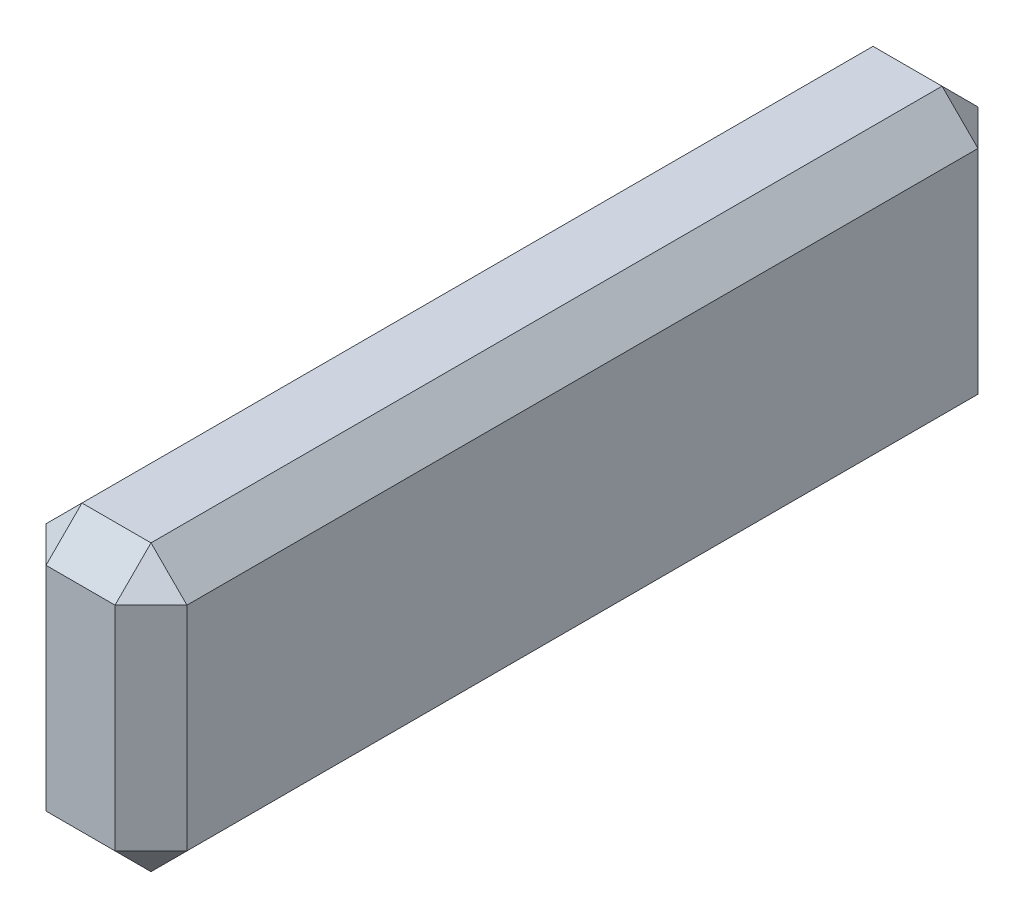
ISO-10303-21;
HEADER;
FILE_DESCRIPTION(('STEP AP214'),'2;1');
FILE_NAME('part.step','',(''),(''),'','','');
FILE_SCHEMA(('AUTOMOTIVE_DESIGN { 1 0 10303 214 1 1 1 1 }'));
ENDSEC;
DATA;
#1=APPLICATION_CONTEXT('core data for automotive mechanical design processes');
#2=APPLICATION_PROTOCOL_DEFINITION('international standard','automotive_design',2000,#1);
#3=PRODUCT_CONTEXT('',#1,'mechanical');
#4=PRODUCT('Part','Part','',(#3));
#5=PRODUCT_RELATED_PRODUCT_CATEGORY('part','',(#4));
#6=PRODUCT_DEFINITION_FORMATION('','',#4);
#7=PRODUCT_DEFINITION_CONTEXT('part definition',#1,'design');
#8=PRODUCT_DEFINITION('design','',#6,#7);
#9=PRODUCT_DEFINITION_SHAPE('','',#8);
#10=(LENGTH_UNIT() NAMED_UNIT(*) SI_UNIT(.MILLI.,.METRE.));
#11=(NAMED_UNIT(*) PLANE_ANGLE_UNIT() SI_UNIT($,.RADIAN.));
#12=(NAMED_UNIT(*) SI_UNIT($,.STERADIAN.) SOLID_ANGLE_UNIT());
#13=UNCERTAINTY_MEASURE_WITH_UNIT(LENGTH_MEASURE(1.E-05),#10,'distance_accuracy_value','');
#14=(GEOMETRIC_REPRESENTATION_CONTEXT(3) GLOBAL_UNCERTAINTY_ASSIGNED_CONTEXT((#13)) GLOBAL_UNIT_ASSIGNED_CONTEXT((#10,
#11,#12)) REPRESENTATION_CONTEXT('',''));
#15=CARTESIAN_POINT('',(0.,0.,0.));
#16=DIRECTION('',(0.,0.,1.));
#17=DIRECTION('',(1.,0.,0.));
#18=AXIS2_PLACEMENT_3D('',#15,#16,#17);
#19=CARTESIAN_POINT('',(3.1115,-6.2865,38.1));
#20=DIRECTION('',(-1.,0.,0.));
#21=DIRECTION('',(0.,0.,1.));
#22=AXIS2_PLACEMENT_3D('',#19,#20,#21);
#23=PLANE('',#22);
#24=DIRECTION('',(0.,-1.,0.));
#25=VECTOR('',#24,1.);
#26=CARTESIAN_POINT('',(3.1115,-6.2865,36.5125));
#27=LINE('',#26,#25);
#28=CARTESIAN_POINT('',(3.1115,4.69899999999999,36.5125));
#29=VERTEX_POINT('',#28);
#30=CARTESIAN_POINT('',(3.1115,-4.699,36.5125));
#31=VERTEX_POINT('',#30);
#32=EDGE_CURVE('E195',#29,#31,#27,.T.);
#33=ORIENTED_EDGE('',*,*,#32,.T.);
#34=DIRECTION('',(0.,0.,-1.));
#35=VECTOR('',#34,1.);
#36=CARTESIAN_POINT('',(3.1115,-4.699,38.1));
#37=LINE('',#36,#35);
#38=CARTESIAN_POINT('',(3.1115,-4.699,1.5875));
#39=VERTEX_POINT('',#38);
#40=EDGE_CURVE('E197',#31,#39,#37,.T.);
#41=ORIENTED_EDGE('',*,*,#40,.T.);
#42=DIRECTION('',(0.,1.,0.));
#43=VECTOR('',#42,1.);
#44=CARTESIAN_POINT('',(3.1115,6.2865,1.5875));
#45=LINE('',#44,#43);
#46=CARTESIAN_POINT('',(3.1115,4.69899999999999,1.5875));
#47=VERTEX_POINT('',#46);
#48=EDGE_CURVE('E191',#39,#47,#45,.T.);
#49=ORIENTED_EDGE('',*,*,#48,.T.);
#50=DIRECTION('',(0.,0.,1.));
#51=VECTOR('',#50,1.);
#52=CARTESIAN_POINT('',(3.1115,4.69899999999999,38.1));
#53=LINE('',#52,#51);
#54=EDGE_CURVE('E193',#47,#29,#53,.T.);
#55=ORIENTED_EDGE('',*,*,#54,.T.);
#56=EDGE_LOOP('',(#33,#41,#49,#55));
#57=FACE_BOUND('',#56,.T.);
#58=ADVANCED_FACE('F35',(#57),#23,.F.);
#59=CARTESIAN_POINT('',(-3.1115,6.2865,38.1));
#60=DIRECTION('',(0.,-1.,0.));
#61=DIRECTION('',(0.,0.,-1.));
#62=AXIS2_PLACEMENT_3D('',#59,#60,#61);
#63=PLANE('',#62);
#64=DIRECTION('',(0.,0.,1.));
#65=VECTOR('',#64,1.);
#66=CARTESIAN_POINT('',(-1.52399999999999,6.2865,38.1));
#67=LINE('',#66,#65);
#68=CARTESIAN_POINT('',(-1.52399999999999,6.2865,1.5875));
#69=VERTEX_POINT('',#68);
#70=CARTESIAN_POINT('',(-1.52399999999999,6.2865,36.5125));
#71=VERTEX_POINT('',#70);
#72=EDGE_CURVE('E184',#69,#71,#67,.T.);
#73=ORIENTED_EDGE('',*,*,#72,.T.);
#74=DIRECTION('',(1.,0.,0.));
#75=VECTOR('',#74,1.);
#76=CARTESIAN_POINT('',(-3.1115,6.2865,36.5125));
#77=LINE('',#76,#75);
#78=CARTESIAN_POINT('',(1.524,6.2865,36.5125));
#79=VERTEX_POINT('',#78);
#80=EDGE_CURVE('E142',#71,#79,#77,.T.);
#81=ORIENTED_EDGE('',*,*,#80,.T.);
#82=DIRECTION('',(0.,0.,-1.));
#83=VECTOR('',#82,1.);
#84=CARTESIAN_POINT('',(1.524,6.2865,38.1));
#85=LINE('',#84,#83);
#86=CARTESIAN_POINT('',(1.524,6.2865,1.5875));
#87=VERTEX_POINT('',#86);
#88=EDGE_CURVE('E188',#79,#87,#85,.T.);
#89=ORIENTED_EDGE('',*,*,#88,.T.);
#90=DIRECTION('',(-1.,0.,0.));
#91=VECTOR('',#90,1.);
#92=CARTESIAN_POINT('',(-3.1115,6.2865,1.5875));
#93=LINE('',#92,#91);
#94=EDGE_CURVE('E186',#87,#69,#93,.T.);
#95=ORIENTED_EDGE('',*,*,#94,.T.);
#96=EDGE_LOOP('',(#73,#81,#89,#95));
#97=FACE_BOUND('',#96,.T.);
#98=ADVANCED_FACE('F297',(#97),#63,.F.);
#99=CARTESIAN_POINT('',(-3.1115,-6.2865,38.1));
#100=DIRECTION('',(1.,0.,0.));
#101=DIRECTION('',(0.,0.,-1.));
#102=AXIS2_PLACEMENT_3D('',#99,#100,#101);
#103=PLANE('',#102);
#104=DIRECTION('',(0.,1.,0.));
#105=VECTOR('',#104,1.);
#106=CARTESIAN_POINT('',(-3.1115,-6.2865,36.5125));
#107=LINE('',#106,#105);
#108=CARTESIAN_POINT('',(-3.1115,-4.699,36.5125));
#109=VERTEX_POINT('',#108);
#110=CARTESIAN_POINT('',(-3.1115,4.69899999999999,36.5125));
#111=VERTEX_POINT('',#110);
#112=EDGE_CURVE('E44',#109,#111,#107,.T.);
#113=ORIENTED_EDGE('',*,*,#112,.T.);
#114=DIRECTION('',(0.,0.,-1.));
#115=VECTOR('',#114,1.);
#116=CARTESIAN_POINT('',(-3.1115,4.69899999999999,38.1));
#117=LINE('',#116,#115);
#118=CARTESIAN_POINT('',(-3.1115,4.69899999999999,1.5875));
#119=VERTEX_POINT('',#118);
#120=EDGE_CURVE('E11',#111,#119,#117,.T.);
#121=ORIENTED_EDGE('',*,*,#120,.T.);
#122=DIRECTION('',(0.,-1.,0.));
#123=VECTOR('',#122,1.);
#124=CARTESIAN_POINT('',(-3.1115,-6.2865,1.5875));
#125=LINE('',#124,#123);
#126=CARTESIAN_POINT('',(-3.1115,-4.699,1.5875));
#127=VERTEX_POINT('',#126);
#128=EDGE_CURVE('E200',#119,#127,#125,.T.);
#129=ORIENTED_EDGE('',*,*,#128,.T.);
#130=DIRECTION('',(0.,0.,1.));
#131=VECTOR('',#130,1.);
#132=CARTESIAN_POINT('',(-3.1115,-4.699,38.1));
#133=LINE('',#132,#131);
#134=EDGE_CURVE('E55',#127,#109,#133,.T.);
#135=ORIENTED_EDGE('',*,*,#134,.T.);
#136=EDGE_LOOP('',(#113,#121,#129,#135));
#137=FACE_BOUND('',#136,.T.);
#138=ADVANCED_FACE('F299',(#137),#103,.F.);
#139=CARTESIAN_POINT('',(-3.1115,-6.2865,38.1));
#140=DIRECTION('',(0.,1.,0.));
#141=DIRECTION('',(0.,0.,1.));
#142=AXIS2_PLACEMENT_3D('',#139,#140,#141);
#143=PLANE('',#142);
#144=DIRECTION('',(1.,0.,0.));
#145=VECTOR('',#144,1.);
#146=CARTESIAN_POINT('',(3.1115,-6.2865,1.5875));
#147=LINE('',#146,#145);
#148=CARTESIAN_POINT('',(-1.524,-6.2865,1.5875));
#149=VERTEX_POINT('',#148);
#150=CARTESIAN_POINT('',(1.52399999999999,-6.2865,1.5875));
#151=VERTEX_POINT('',#150);
#152=EDGE_CURVE('E168',#149,#151,#147,.T.);
#153=ORIENTED_EDGE('',*,*,#152,.T.);
#154=DIRECTION('',(0.,0.,1.));
#155=VECTOR('',#154,1.);
#156=CARTESIAN_POINT('',(1.52399999999999,-6.2865,38.1));
#157=LINE('',#156,#155);
#158=CARTESIAN_POINT('',(1.52399999999999,-6.2865,36.5125));
#159=VERTEX_POINT('',#158);
#160=EDGE_CURVE('E173',#151,#159,#157,.T.);
#161=ORIENTED_EDGE('',*,*,#160,.T.);
#162=DIRECTION('',(-1.,0.,0.));
#163=VECTOR('',#162,1.);
#164=CARTESIAN_POINT('',(-3.1115,-6.2865,36.5125));
#165=LINE('',#164,#163);
#166=CARTESIAN_POINT('',(-1.524,-6.2865,36.5125));
#167=VERTEX_POINT('',#166);
#168=EDGE_CURVE('E170',#159,#167,#165,.T.);
#169=ORIENTED_EDGE('',*,*,#168,.T.);
#170=DIRECTION('',(0.,0.,-1.));
#171=VECTOR('',#170,1.);
#172=CARTESIAN_POINT('',(-1.524,-6.2865,38.1));
#173=LINE('',#172,#171);
#174=EDGE_CURVE('E166',#167,#149,#173,.T.);
#175=ORIENTED_EDGE('',*,*,#174,.T.);
#176=EDGE_LOOP('',(#153,#161,#169,#175));
#177=FACE_BOUND('',#176,.T.);
#178=ADVANCED_FACE('F305',(#177),#143,.F.);
#179=CARTESIAN_POINT('',(0.,0.,38.1));
#180=DIRECTION('',(0.,0.,-1.));
#181=DIRECTION('',(-1.,0.,0.));
#182=AXIS2_PLACEMENT_3D('',#179,#180,#181);
#183=PLANE('',#182);
#184=DIRECTION('',(1.,0.,0.));
#185=VECTOR('',#184,1.);
#186=CARTESIAN_POINT('',(0.,-4.699,38.1));
#187=LINE('',#186,#185);
#188=CARTESIAN_POINT('',(-1.524,-4.699,38.1));
#189=VERTEX_POINT('',#188);
#190=CARTESIAN_POINT('',(1.524,-4.699,38.1));
#191=VERTEX_POINT('',#190);
#192=EDGE_CURVE('E134',#189,#191,#187,.T.);
#193=ORIENTED_EDGE('',*,*,#192,.T.);
#194=DIRECTION('',(0.,1.,0.));
#195=VECTOR('',#194,1.);
#196=CARTESIAN_POINT('',(1.524,0.,38.1));
#197=LINE('',#196,#195);
#198=CARTESIAN_POINT('',(1.524,4.699,38.1));
#199=VERTEX_POINT('',#198);
#200=EDGE_CURVE('E130',#191,#199,#197,.T.);
#201=ORIENTED_EDGE('',*,*,#200,.T.);
#202=DIRECTION('',(-1.,0.,0.));
#203=VECTOR('',#202,1.);
#204=CARTESIAN_POINT('',(0.,4.699,38.1));
#205=LINE('',#204,#203);
#206=CARTESIAN_POINT('',(-1.524,4.699,38.1));
#207=VERTEX_POINT('',#206);
#208=EDGE_CURVE('E122',#199,#207,#205,.T.);
#209=ORIENTED_EDGE('',*,*,#208,.T.);
#210=DIRECTION('',(0.,-1.,0.));
#211=VECTOR('',#210,1.);
#212=CARTESIAN_POINT('',(-1.524,0.,38.1));
#213=LINE('',#212,#211);
#214=EDGE_CURVE('E127',#207,#189,#213,.T.);
#215=ORIENTED_EDGE('',*,*,#214,.T.);
#216=EDGE_LOOP('',(#193,#201,#209,#215));
#217=FACE_BOUND('',#216,.T.);
#218=ADVANCED_FACE('F125',(#217),#183,.F.);
#219=CARTESIAN_POINT('',(0.,0.,0.));
#220=DIRECTION('',(0.,0.,-1.));
#221=DIRECTION('',(-1.,0.,0.));
#222=AXIS2_PLACEMENT_3D('',#219,#220,#221);
#223=PLANE('',#222);
#224=DIRECTION('',(0.,-1.,0.));
#225=VECTOR('',#224,1.);
#226=CARTESIAN_POINT('',(1.52399999999999,-6.2865,0.));
#227=LINE('',#226,#225);
#228=CARTESIAN_POINT('',(1.52399999999999,4.69899999999999,0.));
#229=VERTEX_POINT('',#228);
#230=CARTESIAN_POINT('',(1.52399999999999,-4.69899999999999,0.));
#231=VERTEX_POINT('',#230);
#232=EDGE_CURVE('E179',#229,#231,#227,.T.);
#233=ORIENTED_EDGE('',*,*,#232,.T.);
#234=DIRECTION('',(-1.,0.,0.));
#235=VECTOR('',#234,1.);
#236=CARTESIAN_POINT('',(-3.1115,-4.69899999999999,0.));
#237=LINE('',#236,#235);
#238=CARTESIAN_POINT('',(-1.52399999999999,-4.69899999999999,0.));
#239=VERTEX_POINT('',#238);
#240=EDGE_CURVE('E181',#231,#239,#237,.T.);
#241=ORIENTED_EDGE('',*,*,#240,.T.);
#242=DIRECTION('',(0.,1.,0.));
#243=VECTOR('',#242,1.);
#244=CARTESIAN_POINT('',(-1.52399999999999,6.2865,0.));
#245=LINE('',#244,#243);
#246=CARTESIAN_POINT('',(-1.52399999999999,4.69899999999999,0.));
#247=VERTEX_POINT('',#246);
#248=EDGE_CURVE('E175',#239,#247,#245,.T.);
#249=ORIENTED_EDGE('',*,*,#248,.T.);
#250=DIRECTION('',(1.,0.,0.));
#251=VECTOR('',#250,1.);
#252=CARTESIAN_POINT('',(3.1115,4.69899999999999,0.));
#253=LINE('',#252,#251);
#254=EDGE_CURVE('E177',#247,#229,#253,.T.);
#255=ORIENTED_EDGE('',*,*,#254,.T.);
#256=EDGE_LOOP('',(#233,#241,#249,#255));
#257=FACE_BOUND('',#256,.T.);
#258=ADVANCED_FACE('F275',(#257),#223,.T.);
#259=CARTESIAN_POINT('',(-3.1115,6.2865,1.5875));
#260=DIRECTION('',(0.,0.707106781186546,-0.707106781186549));
#261=DIRECTION('',(1.,0.,0.));
#262=AXIS2_PLACEMENT_3D('',#259,#260,#261);
#263=PLANE('',#262);
#264=DIRECTION('',(0.,-0.707106781186549,-0.707106781186546));
#265=VECTOR('',#264,1.);
#266=CARTESIAN_POINT('',(-1.52399999999999,6.2865,1.5875));
#267=LINE('',#266,#265);
#268=EDGE_CURVE('E39',#69,#247,#267,.T.);
#269=ORIENTED_EDGE('',*,*,#268,.F.);
#270=ORIENTED_EDGE('',*,*,#94,.F.);
#271=DIRECTION('',(0.,0.707106781186549,0.707106781186546));
#272=VECTOR('',#271,1.);
#273=CARTESIAN_POINT('',(1.524,6.2865,1.5875));
#274=LINE('',#273,#272);
#275=EDGE_CURVE('E162',#229,#87,#274,.T.);
#276=ORIENTED_EDGE('',*,*,#275,.F.);
#277=ORIENTED_EDGE('',*,*,#254,.F.);
#278=EDGE_LOOP('',(#269,#270,#276,#277));
#279=FACE_BOUND('',#278,.T.);
#280=ADVANCED_FACE('F37',(#279),#263,.T.);
#281=CARTESIAN_POINT('',(-1.52399999999999,6.2865,1.5875));
#282=DIRECTION('',(-0.577350269189625,0.577350269189625,-0.577350269189628));
#283=DIRECTION('',(0.,0.707106781186549,0.707106781186546));
#284=AXIS2_PLACEMENT_3D('',#281,#282,#283);
#285=PLANE('',#284);
#286=DIRECTION('',(-0.707106781186548,-0.707106781186547,0.));
#287=VECTOR('',#286,1.);
#288=CARTESIAN_POINT('',(-1.524,6.2865,1.5875));
#289=LINE('',#288,#287);
#290=EDGE_CURVE('E245',#69,#119,#289,.T.);
#291=ORIENTED_EDGE('',*,*,#290,.F.);
#292=ORIENTED_EDGE('',*,*,#268,.T.);
#293=DIRECTION('',(-0.707106781186549,0.,0.707106781186546));
#294=VECTOR('',#293,1.);
#295=CARTESIAN_POINT('',(-2.31775,4.69899999999999,0.793749999999997));
#296=LINE('',#295,#294);
#297=EDGE_CURVE('E248',#119,#247,#296,.F.);
#298=ORIENTED_EDGE('',*,*,#297,.F.);
#299=EDGE_LOOP('',(#291,#292,#298));
#300=FACE_BOUND('',#299,.T.);
#301=ADVANCED_FACE('F292',(#300),#285,.T.);
#302=CARTESIAN_POINT('',(1.524,6.2865,1.5875));
#303=DIRECTION('',(0.577350269189626,0.577350269189624,-0.577350269189628));
#304=DIRECTION('',(-0.707106781186549,0.,-0.707106781186547));
#305=AXIS2_PLACEMENT_3D('',#302,#303,#304);
#306=PLANE('',#305);
#307=DIRECTION('',(-0.707106781186549,0.,-0.707106781186546));
#308=VECTOR('',#307,1.);
#309=CARTESIAN_POINT('',(2.31774999999999,4.69899999999999,0.793749999999997));
#310=LINE('',#309,#308);
#311=EDGE_CURVE('E239',#229,#47,#310,.F.);
#312=ORIENTED_EDGE('',*,*,#311,.F.);
#313=ORIENTED_EDGE('',*,*,#275,.T.);
#314=DIRECTION('',(-0.707106781186546,0.707106781186549,0.));
#315=VECTOR('',#314,1.);
#316=CARTESIAN_POINT('',(1.524,6.2865,1.5875));
#317=LINE('',#316,#315);
#318=EDGE_CURVE('E242',#47,#87,#317,.T.);
#319=ORIENTED_EDGE('',*,*,#318,.F.);
#320=EDGE_LOOP('',(#312,#313,#319));
#321=FACE_BOUND('',#320,.T.);
#322=ADVANCED_FACE('F255',(#321),#306,.T.);
#323=CARTESIAN_POINT('',(-3.1115,-6.2865,1.5875));
#324=DIRECTION('',(-0.707106781186546,0.,-0.707106781186549));
#325=DIRECTION('',(0.,1.,0.));
#326=AXIS2_PLACEMENT_3D('',#323,#324,#325);
#327=PLANE('',#326);
#328=ORIENTED_EDGE('',*,*,#297,.T.);
#329=ORIENTED_EDGE('',*,*,#248,.F.);
#330=DIRECTION('',(0.707106781186549,0.,-0.707106781186546));
#331=VECTOR('',#330,1.);
#332=CARTESIAN_POINT('',(-1.52399999999999,-4.69899999999999,0.));
#333=LINE('',#332,#331);
#334=EDGE_CURVE('E234',#127,#239,#333,.T.);
#335=ORIENTED_EDGE('',*,*,#334,.F.);
#336=ORIENTED_EDGE('',*,*,#128,.F.);
#337=EDGE_LOOP('',(#328,#329,#335,#336));
#338=FACE_BOUND('',#337,.T.);
#339=ADVANCED_FACE('F287',(#338),#327,.T.);
#340=CARTESIAN_POINT('',(-3.1115,4.69899999999999,38.1));
#341=DIRECTION('',(0.707106781186547,-0.707106781186548,0.));
#342=DIRECTION('',(0.,0.,-1.));
#343=AXIS2_PLACEMENT_3D('',#340,#341,#342);
#344=PLANE('',#343);
#345=ORIENTED_EDGE('',*,*,#290,.T.);
#346=ORIENTED_EDGE('',*,*,#120,.F.);
#347=DIRECTION('',(0.707106781186548,0.707106781186547,0.));
#348=VECTOR('',#347,1.);
#349=CARTESIAN_POINT('',(-2.31775,5.49274999999999,36.5125));
#350=LINE('',#349,#348);
#351=EDGE_CURVE('E146',#71,#111,#350,.F.);
#352=ORIENTED_EDGE('',*,*,#351,.F.);
#353=ORIENTED_EDGE('',*,*,#72,.F.);
#354=EDGE_LOOP('',(#345,#346,#352,#353));
#355=FACE_BOUND('',#354,.T.);
#356=ADVANCED_FACE('F295',(#355),#344,.F.);
#357=CARTESIAN_POINT('',(0.,4.699,38.1));
#358=DIRECTION('',(0.,-0.707106781186548,-0.707106781186547));
#359=DIRECTION('',(-1.,0.,0.));
#360=AXIS2_PLACEMENT_3D('',#357,#358,#359);
#361=PLANE('',#360);
#362=DIRECTION('',(0.,0.707106781186547,-0.707106781186548));
#363=VECTOR('',#362,1.);
#364=CARTESIAN_POINT('',(1.524,6.2865,36.5125));
#365=LINE('',#364,#363);
#366=EDGE_CURVE('E147',#79,#199,#365,.F.);
#367=ORIENTED_EDGE('',*,*,#366,.F.);
#368=ORIENTED_EDGE('',*,*,#80,.F.);
#369=DIRECTION('',(0.,-0.707106781186547,0.707106781186548));
#370=VECTOR('',#369,1.);
#371=CARTESIAN_POINT('',(-1.524,4.699,38.1));
#372=LINE('',#371,#370);
#373=EDGE_CURVE('E138',#207,#71,#372,.F.);
#374=ORIENTED_EDGE('',*,*,#373,.F.);
#375=ORIENTED_EDGE('',*,*,#208,.F.);
#376=EDGE_LOOP('',(#367,#368,#374,#375));
#377=FACE_BOUND('',#376,.T.);
#378=ADVANCED_FACE('F140',(#377),#361,.F.);
#379=CARTESIAN_POINT('',(1.524,6.2865,38.1));
#380=DIRECTION('',(-0.707106781186549,-0.707106781186546,0.));
#381=DIRECTION('',(0.,0.,-1.));
#382=AXIS2_PLACEMENT_3D('',#379,#380,#381);
#383=PLANE('',#382);
#384=ORIENTED_EDGE('',*,*,#318,.T.);
#385=ORIENTED_EDGE('',*,*,#88,.F.);
#386=DIRECTION('',(0.707106781186546,-0.707106781186549,0.));
#387=VECTOR('',#386,1.);
#388=CARTESIAN_POINT('',(1.524,6.2865,36.5125));
#389=LINE('',#388,#387);
#390=EDGE_CURVE('E230',#29,#79,#389,.F.);
#391=ORIENTED_EDGE('',*,*,#390,.F.);
#392=ORIENTED_EDGE('',*,*,#54,.F.);
#393=EDGE_LOOP('',(#384,#385,#391,#392));
#394=FACE_BOUND('',#393,.T.);
#395=ADVANCED_FACE('F263',(#394),#383,.F.);
#396=CARTESIAN_POINT('',(3.1115,-6.2865,1.5875));
#397=DIRECTION('',(0.707106781186546,0.,-0.707106781186549));
#398=DIRECTION('',(0.,-1.,0.));
#399=AXIS2_PLACEMENT_3D('',#396,#397,#398);
#400=PLANE('',#399);
#401=ORIENTED_EDGE('',*,*,#311,.T.);
#402=ORIENTED_EDGE('',*,*,#48,.F.);
#403=DIRECTION('',(0.707106781186549,0.,0.707106781186546));
#404=VECTOR('',#403,1.);
#405=CARTESIAN_POINT('',(2.31775,-4.699,0.793749999999998));
#406=LINE('',#405,#404);
#407=EDGE_CURVE('E227',#231,#39,#406,.T.);
#408=ORIENTED_EDGE('',*,*,#407,.F.);
#409=ORIENTED_EDGE('',*,*,#232,.F.);
#410=EDGE_LOOP('',(#401,#402,#408,#409));
#411=FACE_BOUND('',#410,.T.);
#412=ADVANCED_FACE('F272',(#411),#400,.T.);
#413=CARTESIAN_POINT('',(-3.1115,-6.2865,1.5875));
#414=DIRECTION('',(0.,-0.707106781186546,-0.707106781186549));
#415=DIRECTION('',(-1.,0.,0.));
#416=AXIS2_PLACEMENT_3D('',#413,#414,#415);
#417=PLANE('',#416);
#418=DIRECTION('',(0.,-0.707106781186549,0.707106781186546));
#419=VECTOR('',#418,1.);
#420=CARTESIAN_POINT('',(-1.52399999999999,-4.69899999999999,0.));
#421=LINE('',#420,#419);
#422=EDGE_CURVE('E236',#239,#149,#421,.T.);
#423=ORIENTED_EDGE('',*,*,#422,.F.);
#424=ORIENTED_EDGE('',*,*,#240,.F.);
#425=DIRECTION('',(0.,0.707106781186549,-0.707106781186546));
#426=VECTOR('',#425,1.);
#427=CARTESIAN_POINT('',(1.52399999999999,-6.2865,1.5875));
#428=LINE('',#427,#426);
#429=EDGE_CURVE('E224',#151,#231,#428,.T.);
#430=ORIENTED_EDGE('',*,*,#429,.F.);
#431=ORIENTED_EDGE('',*,*,#152,.F.);
#432=EDGE_LOOP('',(#423,#424,#430,#431));
#433=FACE_BOUND('',#432,.T.);
#434=ADVANCED_FACE('F279',(#433),#417,.T.);
#435=CARTESIAN_POINT('',(-1.52399999999999,-4.69899999999999,0.));
#436=DIRECTION('',(-0.577350269189624,-0.577350269189625,-0.577350269189628));
#437=DIRECTION('',(0.,0.707106781186549,-0.707106781186546));
#438=AXIS2_PLACEMENT_3D('',#435,#436,#437);
#439=PLANE('',#438);
#440=ORIENTED_EDGE('',*,*,#334,.T.);
#441=ORIENTED_EDGE('',*,*,#422,.T.);
#442=DIRECTION('',(0.707106781186548,-0.707106781186547,0.));
#443=VECTOR('',#442,1.);
#444=CARTESIAN_POINT('',(-2.31775,-5.49275,1.5875));
#445=LINE('',#444,#443);
#446=EDGE_CURVE('E153',#127,#149,#445,.T.);
#447=ORIENTED_EDGE('',*,*,#446,.F.);
#448=EDGE_LOOP('',(#440,#441,#447));
#449=FACE_BOUND('',#448,.T.);
#450=ADVANCED_FACE('F346',(#449),#439,.T.);
#451=CARTESIAN_POINT('',(-1.524,4.699,38.1));
#452=DIRECTION('',(-0.577350269189624,0.577350269189627,0.577350269189626));
#453=DIRECTION('',(0.,-0.707106781186547,0.707106781186548));
#454=AXIS2_PLACEMENT_3D('',#451,#452,#453);
#455=PLANE('',#454);
#456=ORIENTED_EDGE('',*,*,#373,.T.);
#457=ORIENTED_EDGE('',*,*,#351,.T.);
#458=DIRECTION('',(-0.707106781186549,0.,-0.707106781186546));
#459=VECTOR('',#458,1.);
#460=CARTESIAN_POINT('',(-1.524,4.699,38.1));
#461=LINE('',#460,#459);
#462=EDGE_CURVE('E150',#207,#111,#461,.T.);
#463=ORIENTED_EDGE('',*,*,#462,.F.);
#464=EDGE_LOOP('',(#456,#457,#463));
#465=FACE_BOUND('',#464,.T.);
#466=ADVANCED_FACE('F151',(#465),#455,.T.);
#467=CARTESIAN_POINT('',(1.524,6.2865,36.5125));
#468=DIRECTION('',(0.577350269189627,0.577350269189626,0.577350269189624));
#469=DIRECTION('',(-0.707106781186546,0.707106781186549,0.));
#470=AXIS2_PLACEMENT_3D('',#467,#468,#469);
#471=PLANE('',#470);
#472=ORIENTED_EDGE('',*,*,#390,.T.);
#473=ORIENTED_EDGE('',*,*,#366,.T.);
#474=DIRECTION('',(-0.707106781186546,0.,0.707106781186548));
#475=VECTOR('',#474,1.);
#476=CARTESIAN_POINT('',(2.31775,4.69899999999999,37.30625));
#477=LINE('',#476,#475);
#478=EDGE_CURVE('E154',#29,#199,#477,.T.);
#479=ORIENTED_EDGE('',*,*,#478,.F.);
#480=EDGE_LOOP('',(#472,#473,#479));
#481=FACE_BOUND('',#480,.T.);
#482=ADVANCED_FACE('F339',(#481),#471,.T.);
#483=CARTESIAN_POINT('',(1.52399999999999,-6.2865,1.5875));
#484=DIRECTION('',(0.577350269189624,-0.577350269189626,-0.577350269189628));
#485=DIRECTION('',(0.,0.707106781186549,-0.707106781186546));
#486=AXIS2_PLACEMENT_3D('',#483,#484,#485);
#487=PLANE('',#486);
#488=ORIENTED_EDGE('',*,*,#429,.T.);
#489=ORIENTED_EDGE('',*,*,#407,.T.);
#490=DIRECTION('',(0.707106781186548,0.707106781186547,0.));
#491=VECTOR('',#490,1.);
#492=CARTESIAN_POINT('',(1.52399999999999,-6.2865,1.5875));
#493=LINE('',#492,#491);
#494=EDGE_CURVE('E218',#151,#39,#493,.T.);
#495=ORIENTED_EDGE('',*,*,#494,.F.);
#496=EDGE_LOOP('',(#488,#489,#495));
#497=FACE_BOUND('',#496,.T.);
#498=ADVANCED_FACE('F335',(#497),#487,.T.);
#499=CARTESIAN_POINT('',(-1.524,-6.2865,38.1));
#500=DIRECTION('',(0.707106781186547,0.707106781186548,0.));
#501=DIRECTION('',(0.,0.,-1.));
#502=AXIS2_PLACEMENT_3D('',#499,#500,#501);
#503=PLANE('',#502);
#504=ORIENTED_EDGE('',*,*,#446,.T.);
#505=ORIENTED_EDGE('',*,*,#174,.F.);
#506=DIRECTION('',(-0.707106781186548,0.707106781186547,0.));
#507=VECTOR('',#506,1.);
#508=CARTESIAN_POINT('',(-1.524,-6.2865,36.5125));
#509=LINE('',#508,#507);
#510=EDGE_CURVE('E215',#109,#167,#509,.F.);
#511=ORIENTED_EDGE('',*,*,#510,.F.);
#512=ORIENTED_EDGE('',*,*,#134,.F.);
#513=EDGE_LOOP('',(#504,#505,#511,#512));
#514=FACE_BOUND('',#513,.T.);
#515=ADVANCED_FACE('F332',(#514),#503,.F.);
#516=CARTESIAN_POINT('',(-1.524,0.,38.1));
#517=DIRECTION('',(0.707106781186546,0.,-0.707106781186549));
#518=DIRECTION('',(0.,-1.,0.));
#519=AXIS2_PLACEMENT_3D('',#516,#517,#518);
#520=PLANE('',#519);
#521=ORIENTED_EDGE('',*,*,#462,.T.);
#522=ORIENTED_EDGE('',*,*,#112,.F.);
#523=DIRECTION('',(0.707106781186549,0.,0.707106781186546));
#524=VECTOR('',#523,1.);
#525=CARTESIAN_POINT('',(-2.31775,-4.699,37.30625));
#526=LINE('',#525,#524);
#527=EDGE_CURVE('E158',#189,#109,#526,.F.);
#528=ORIENTED_EDGE('',*,*,#527,.F.);
#529=ORIENTED_EDGE('',*,*,#214,.F.);
#530=EDGE_LOOP('',(#521,#522,#528,#529));
#531=FACE_BOUND('',#530,.T.);
#532=ADVANCED_FACE('F156',(#531),#520,.F.);
#533=CARTESIAN_POINT('',(1.524,0.,38.1));
#534=DIRECTION('',(-0.707106781186548,0.,-0.707106781186547));
#535=DIRECTION('',(0.,1.,0.));
#536=AXIS2_PLACEMENT_3D('',#533,#534,#535);
#537=PLANE('',#536);
#538=ORIENTED_EDGE('',*,*,#478,.T.);
#539=ORIENTED_EDGE('',*,*,#200,.F.);
#540=DIRECTION('',(0.707106781186547,0.,-0.707106781186548));
#541=VECTOR('',#540,1.);
#542=CARTESIAN_POINT('',(1.524,-4.699,38.1));
#543=LINE('',#542,#541);
#544=EDGE_CURVE('E211',#31,#191,#543,.F.);
#545=ORIENTED_EDGE('',*,*,#544,.F.);
#546=ORIENTED_EDGE('',*,*,#32,.F.);
#547=EDGE_LOOP('',(#538,#539,#545,#546));
#548=FACE_BOUND('',#547,.T.);
#549=ADVANCED_FACE('F325',(#548),#537,.F.);
#550=CARTESIAN_POINT('',(3.1115,-4.699,38.1));
#551=DIRECTION('',(-0.707106781186547,0.707106781186548,0.));
#552=DIRECTION('',(0.,0.,-1.));
#553=AXIS2_PLACEMENT_3D('',#550,#551,#552);
#554=PLANE('',#553);
#555=ORIENTED_EDGE('',*,*,#494,.T.);
#556=ORIENTED_EDGE('',*,*,#40,.F.);
#557=DIRECTION('',(-0.707106781186548,-0.707106781186547,0.));
#558=VECTOR('',#557,1.);
#559=CARTESIAN_POINT('',(2.31775,-5.49275,36.5125));
#560=LINE('',#559,#558);
#561=EDGE_CURVE('E208',#159,#31,#560,.F.);
#562=ORIENTED_EDGE('',*,*,#561,.F.);
#563=ORIENTED_EDGE('',*,*,#160,.F.);
#564=EDGE_LOOP('',(#555,#556,#562,#563));
#565=FACE_BOUND('',#564,.T.);
#566=ADVANCED_FACE('F321',(#565),#554,.F.);
#567=CARTESIAN_POINT('',(-1.524,-6.2865,36.5125));
#568=DIRECTION('',(-0.577350269189624,-0.577350269189627,0.577350269189626));
#569=DIRECTION('',(0.,-0.707106781186547,-0.707106781186548));
#570=AXIS2_PLACEMENT_3D('',#567,#568,#569);
#571=PLANE('',#570);
#572=ORIENTED_EDGE('',*,*,#527,.T.);
#573=ORIENTED_EDGE('',*,*,#510,.T.);
#574=DIRECTION('',(0.,-0.707106781186547,-0.707106781186548));
#575=VECTOR('',#574,1.);
#576=CARTESIAN_POINT('',(-1.524,-6.2865,36.5125));
#577=LINE('',#576,#575);
#578=EDGE_CURVE('E206',#189,#167,#577,.T.);
#579=ORIENTED_EDGE('',*,*,#578,.F.);
#580=EDGE_LOOP('',(#572,#573,#579));
#581=FACE_BOUND('',#580,.T.);
#582=ADVANCED_FACE('F317',(#581),#571,.T.);
#583=CARTESIAN_POINT('',(1.524,-4.699,38.1));
#584=DIRECTION('',(0.577350269189626,-0.577350269189627,0.577350269189624));
#585=DIRECTION('',(0.707106781186548,0.707106781186547,0.));
#586=AXIS2_PLACEMENT_3D('',#583,#584,#585);
#587=PLANE('',#586);
#588=ORIENTED_EDGE('',*,*,#561,.T.);
#589=ORIENTED_EDGE('',*,*,#544,.T.);
#590=DIRECTION('',(0.,0.707106781186547,0.707106781186548));
#591=VECTOR('',#590,1.);
#592=CARTESIAN_POINT('',(1.524,-4.699,38.1));
#593=LINE('',#592,#591);
#594=EDGE_CURVE('E204',#159,#191,#593,.T.);
#595=ORIENTED_EDGE('',*,*,#594,.F.);
#596=EDGE_LOOP('',(#588,#589,#595));
#597=FACE_BOUND('',#596,.T.);
#598=ADVANCED_FACE('F313',(#597),#587,.T.);
#599=CARTESIAN_POINT('',(0.,-4.699,38.1));
#600=DIRECTION('',(0.,0.707106781186548,-0.707106781186547));
#601=DIRECTION('',(1.,0.,0.));
#602=AXIS2_PLACEMENT_3D('',#599,#600,#601);
#603=PLANE('',#602);
#604=ORIENTED_EDGE('',*,*,#578,.T.);
#605=ORIENTED_EDGE('',*,*,#168,.F.);
#606=ORIENTED_EDGE('',*,*,#594,.T.);
#607=ORIENTED_EDGE('',*,*,#192,.F.);
#608=EDGE_LOOP('',(#604,#605,#606,#607));
#609=FACE_BOUND('',#608,.T.);
#610=ADVANCED_FACE('F310',(#609),#603,.F.);
#611=CLOSED_SHELL('',(#58,#98,#138,#178,#218,#258,#280,#301,#322,#339,#356,#378,#395,#412,#434,
#450,#466,#482,#498,#515,#532,#549,#566,#582,#598,#610));
#612=MANIFOLD_SOLID_BREP('B2',#611);
#613=ADVANCED_BREP_SHAPE_REPRESENTATION('',(#18,#612),#14);
#614=SHAPE_DEFINITION_REPRESENTATION(#9,#613);
ENDSEC;
END-ISO-10303-21;
